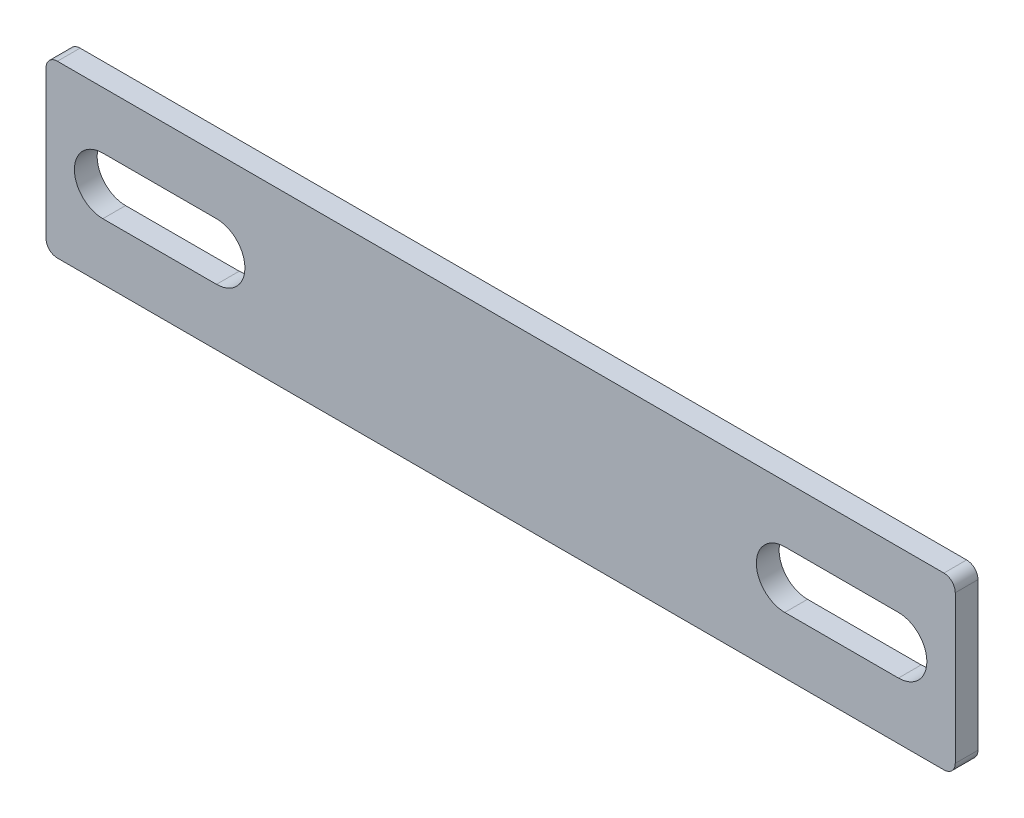
ISO-10303-21;
HEADER;
FILE_DESCRIPTION(('STEP AP214'),'2;1');
FILE_NAME('part.step','',(''),(''),'','','');
FILE_SCHEMA(('AUTOMOTIVE_DESIGN { 1 0 10303 214 1 1 1 1 }'));
ENDSEC;
DATA;
#1=APPLICATION_CONTEXT('core data for automotive mechanical design processes');
#2=APPLICATION_PROTOCOL_DEFINITION('international standard','automotive_design',2000,#1);
#3=PRODUCT_CONTEXT('',#1,'mechanical');
#4=PRODUCT('Part','Part','',(#3));
#5=PRODUCT_RELATED_PRODUCT_CATEGORY('part','',(#4));
#6=PRODUCT_DEFINITION_FORMATION('','',#4);
#7=PRODUCT_DEFINITION_CONTEXT('part definition',#1,'design');
#8=PRODUCT_DEFINITION('design','',#6,#7);
#9=PRODUCT_DEFINITION_SHAPE('','',#8);
#10=(LENGTH_UNIT() NAMED_UNIT(*) SI_UNIT(.MILLI.,.METRE.));
#11=(NAMED_UNIT(*) PLANE_ANGLE_UNIT() SI_UNIT($,.RADIAN.));
#12=(NAMED_UNIT(*) SI_UNIT($,.STERADIAN.) SOLID_ANGLE_UNIT());
#13=UNCERTAINTY_MEASURE_WITH_UNIT(LENGTH_MEASURE(1.E-05),#10,'distance_accuracy_value','');
#14=(GEOMETRIC_REPRESENTATION_CONTEXT(3) GLOBAL_UNCERTAINTY_ASSIGNED_CONTEXT((#13)) GLOBAL_UNIT_ASSIGNED_CONTEXT((#10,
#11,#12)) REPRESENTATION_CONTEXT('',''));
#15=CARTESIAN_POINT('',(0.,0.,0.));
#16=DIRECTION('',(0.,0.,1.));
#17=DIRECTION('',(1.,0.,0.));
#18=AXIS2_PLACEMENT_3D('',#15,#16,#17);
#19=CARTESIAN_POINT('',(-39.,6.5,0.));
#20=DIRECTION('',(0.,0.,1.));
#21=DIRECTION('',(1.,0.,0.));
#22=AXIS2_PLACEMENT_3D('',#19,#20,#21);
#23=CYLINDRICAL_SURFACE('',#22,1.);
#24=CARTESIAN_POINT('',(-39.,6.5,0.));
#25=DIRECTION('',(0.,0.,1.));
#26=DIRECTION('',(1.,0.,0.));
#27=AXIS2_PLACEMENT_3D('',#24,#25,#26);
#28=CIRCLE('',#27,1.);
#29=CARTESIAN_POINT('',(-39.,7.5,0.));
#30=VERTEX_POINT('',#29);
#31=CARTESIAN_POINT('',(-40.,6.5,0.));
#32=VERTEX_POINT('',#31);
#33=EDGE_CURVE('E19',#30,#32,#28,.T.);
#34=ORIENTED_EDGE('',*,*,#33,.T.);
#35=DIRECTION('',(0.,0.,1.));
#36=VECTOR('',#35,1.);
#37=CARTESIAN_POINT('',(-40.,6.5,0.));
#38=LINE('',#37,#36);
#39=CARTESIAN_POINT('',(-40.,6.5,2.));
#40=VERTEX_POINT('',#39);
#41=EDGE_CURVE('E61',#40,#32,#38,.F.);
#42=ORIENTED_EDGE('',*,*,#41,.F.);
#43=CARTESIAN_POINT('',(-39.,6.5,2.));
#44=DIRECTION('',(0.,0.,1.));
#45=DIRECTION('',(1.,0.,0.));
#46=AXIS2_PLACEMENT_3D('',#43,#44,#45);
#47=CIRCLE('',#46,1.);
#48=CARTESIAN_POINT('',(-39.,7.5,2.));
#49=VERTEX_POINT('',#48);
#50=EDGE_CURVE('E193',#49,#40,#47,.T.);
#51=ORIENTED_EDGE('',*,*,#50,.F.);
#52=DIRECTION('',(0.,0.,1.));
#53=VECTOR('',#52,1.);
#54=CARTESIAN_POINT('',(-39.,7.5,0.));
#55=LINE('',#54,#53);
#56=EDGE_CURVE('E63',#30,#49,#55,.T.);
#57=ORIENTED_EDGE('',*,*,#56,.F.);
#58=EDGE_LOOP('',(#34,#42,#51,#57));
#59=FACE_BOUND('',#58,.T.);
#60=ADVANCED_FACE('F16',(#59),#23,.T.);
#61=CARTESIAN_POINT('',(-39.,-6.49999999999999,0.));
#62=DIRECTION('',(0.,0.,1.));
#63=DIRECTION('',(1.,0.,0.));
#64=AXIS2_PLACEMENT_3D('',#61,#62,#63);
#65=CYLINDRICAL_SURFACE('',#64,1.);
#66=CARTESIAN_POINT('',(-39.,-6.49999999999999,0.));
#67=DIRECTION('',(0.,0.,1.));
#68=DIRECTION('',(1.,0.,0.));
#69=AXIS2_PLACEMENT_3D('',#66,#67,#68);
#70=CIRCLE('',#69,1.);
#71=CARTESIAN_POINT('',(-40.,-6.49999999999999,0.));
#72=VERTEX_POINT('',#71);
#73=CARTESIAN_POINT('',(-39.,-7.49999999999999,0.));
#74=VERTEX_POINT('',#73);
#75=EDGE_CURVE('E65',#72,#74,#70,.T.);
#76=ORIENTED_EDGE('',*,*,#75,.T.);
#77=DIRECTION('',(0.,0.,1.));
#78=VECTOR('',#77,1.);
#79=CARTESIAN_POINT('',(-39.,-7.49999999999999,0.));
#80=LINE('',#79,#78);
#81=CARTESIAN_POINT('',(-39.,-7.49999999999999,2.));
#82=VERTEX_POINT('',#81);
#83=EDGE_CURVE('E109',#82,#74,#80,.F.);
#84=ORIENTED_EDGE('',*,*,#83,.F.);
#85=CARTESIAN_POINT('',(-39.,-6.49999999999999,2.));
#86=DIRECTION('',(0.,0.,1.));
#87=DIRECTION('',(1.,0.,0.));
#88=AXIS2_PLACEMENT_3D('',#85,#86,#87);
#89=CIRCLE('',#88,1.);
#90=CARTESIAN_POINT('',(-40.,-6.49999999999999,2.));
#91=VERTEX_POINT('',#90);
#92=EDGE_CURVE('E190',#91,#82,#89,.T.);
#93=ORIENTED_EDGE('',*,*,#92,.F.);
#94=DIRECTION('',(0.,0.,1.));
#95=VECTOR('',#94,1.);
#96=CARTESIAN_POINT('',(-40.,-6.49999999999999,0.));
#97=LINE('',#96,#95);
#98=EDGE_CURVE('E115',#72,#91,#97,.T.);
#99=ORIENTED_EDGE('',*,*,#98,.F.);
#100=EDGE_LOOP('',(#76,#84,#93,#99));
#101=FACE_BOUND('',#100,.T.);
#102=ADVANCED_FACE('F201',(#101),#65,.T.);
#103=CARTESIAN_POINT('',(39.,6.5,0.));
#104=DIRECTION('',(0.,0.,1.));
#105=DIRECTION('',(1.,0.,0.));
#106=AXIS2_PLACEMENT_3D('',#103,#104,#105);
#107=CYLINDRICAL_SURFACE('',#106,1.);
#108=CARTESIAN_POINT('',(39.,6.5,0.));
#109=DIRECTION('',(0.,0.,1.));
#110=DIRECTION('',(1.,0.,0.));
#111=AXIS2_PLACEMENT_3D('',#108,#109,#110);
#112=CIRCLE('',#111,1.);
#113=CARTESIAN_POINT('',(40.,6.5,0.));
#114=VERTEX_POINT('',#113);
#115=CARTESIAN_POINT('',(39.,7.5,0.));
#116=VERTEX_POINT('',#115);
#117=EDGE_CURVE('E34',#114,#116,#112,.T.);
#118=ORIENTED_EDGE('',*,*,#117,.T.);
#119=DIRECTION('',(0.,0.,1.));
#120=VECTOR('',#119,1.);
#121=CARTESIAN_POINT('',(39.,7.5,0.));
#122=LINE('',#121,#120);
#123=CARTESIAN_POINT('',(39.,7.5,2.));
#124=VERTEX_POINT('',#123);
#125=EDGE_CURVE('E118',#124,#116,#122,.F.);
#126=ORIENTED_EDGE('',*,*,#125,.F.);
#127=CARTESIAN_POINT('',(39.,6.5,2.));
#128=DIRECTION('',(0.,0.,1.));
#129=DIRECTION('',(1.,0.,0.));
#130=AXIS2_PLACEMENT_3D('',#127,#128,#129);
#131=CIRCLE('',#130,1.);
#132=CARTESIAN_POINT('',(40.,6.5,2.));
#133=VERTEX_POINT('',#132);
#134=EDGE_CURVE('E196',#133,#124,#131,.T.);
#135=ORIENTED_EDGE('',*,*,#134,.F.);
#136=DIRECTION('',(0.,0.,1.));
#137=VECTOR('',#136,1.);
#138=CARTESIAN_POINT('',(40.,6.5,0.));
#139=LINE('',#138,#137);
#140=EDGE_CURVE('E106',#114,#133,#139,.T.);
#141=ORIENTED_EDGE('',*,*,#140,.F.);
#142=EDGE_LOOP('',(#118,#126,#135,#141));
#143=FACE_BOUND('',#142,.T.);
#144=ADVANCED_FACE('F290',(#143),#107,.T.);
#145=CARTESIAN_POINT('',(0.,0.,2.));
#146=DIRECTION('',(0.,0.,1.));
#147=DIRECTION('',(1.,0.,0.));
#148=AXIS2_PLACEMENT_3D('',#145,#146,#147);
#149=PLANE('',#148);
#150=DIRECTION('',(-1.,0.,0.));
#151=VECTOR('',#150,1.);
#152=CARTESIAN_POINT('',(-25.,2.5,2.));
#153=LINE('',#152,#151);
#154=CARTESIAN_POINT('',(-35.,2.5,2.));
#155=VERTEX_POINT('',#154);
#156=CARTESIAN_POINT('',(-25.,2.5,2.));
#157=VERTEX_POINT('',#156);
#158=EDGE_CURVE('E133',#155,#157,#153,.F.);
#159=ORIENTED_EDGE('',*,*,#158,.T.);
#160=CARTESIAN_POINT('',(-25.,0.,2.));
#161=DIRECTION('',(0.,0.,-1.));
#162=DIRECTION('',(-1.,0.,0.));
#163=AXIS2_PLACEMENT_3D('',#160,#161,#162);
#164=CIRCLE('',#163,2.5);
#165=CARTESIAN_POINT('',(-25.,-2.5,2.));
#166=VERTEX_POINT('',#165);
#167=EDGE_CURVE('E127',#157,#166,#164,.T.);
#168=ORIENTED_EDGE('',*,*,#167,.T.);
#169=DIRECTION('',(1.,0.,0.));
#170=VECTOR('',#169,1.);
#171=CARTESIAN_POINT('',(-35.,-2.5,2.));
#172=LINE('',#171,#170);
#173=CARTESIAN_POINT('',(-35.,-2.5,2.));
#174=VERTEX_POINT('',#173);
#175=EDGE_CURVE('E126',#166,#174,#172,.F.);
#176=ORIENTED_EDGE('',*,*,#175,.T.);
#177=CARTESIAN_POINT('',(-35.,0.,2.));
#178=DIRECTION('',(0.,0.,-1.));
#179=DIRECTION('',(-1.,0.,0.));
#180=AXIS2_PLACEMENT_3D('',#177,#178,#179);
#181=CIRCLE('',#180,2.5);
#182=EDGE_CURVE('E137',#174,#155,#181,.T.);
#183=ORIENTED_EDGE('',*,*,#182,.T.);
#184=EDGE_LOOP('',(#159,#168,#176,#183));
#185=FACE_BOUND('',#184,.T.);
#186=DIRECTION('',(-1.,0.,0.));
#187=VECTOR('',#186,1.);
#188=CARTESIAN_POINT('',(35.,2.5,2.));
#189=LINE('',#188,#187);
#190=CARTESIAN_POINT('',(25.,2.5,2.));
#191=VERTEX_POINT('',#190);
#192=CARTESIAN_POINT('',(35.,2.5,2.));
#193=VERTEX_POINT('',#192);
#194=EDGE_CURVE('E149',#191,#193,#189,.F.);
#195=ORIENTED_EDGE('',*,*,#194,.T.);
#196=CARTESIAN_POINT('',(35.,0.,2.));
#197=DIRECTION('',(0.,0.,-1.));
#198=DIRECTION('',(-1.,0.,0.));
#199=AXIS2_PLACEMENT_3D('',#196,#197,#198);
#200=CIRCLE('',#199,2.5);
#201=CARTESIAN_POINT('',(35.,-2.5,2.));
#202=VERTEX_POINT('',#201);
#203=EDGE_CURVE('E142',#193,#202,#200,.T.);
#204=ORIENTED_EDGE('',*,*,#203,.T.);
#205=DIRECTION('',(1.,0.,0.));
#206=VECTOR('',#205,1.);
#207=CARTESIAN_POINT('',(25.,-2.5,2.));
#208=LINE('',#207,#206);
#209=CARTESIAN_POINT('',(25.,-2.5,2.));
#210=VERTEX_POINT('',#209);
#211=EDGE_CURVE('E141',#202,#210,#208,.F.);
#212=ORIENTED_EDGE('',*,*,#211,.T.);
#213=CARTESIAN_POINT('',(25.,0.,2.));
#214=DIRECTION('',(0.,0.,-1.));
#215=DIRECTION('',(-1.,0.,0.));
#216=AXIS2_PLACEMENT_3D('',#213,#214,#215);
#217=CIRCLE('',#216,2.5);
#218=EDGE_CURVE('E153',#210,#191,#217,.T.);
#219=ORIENTED_EDGE('',*,*,#218,.T.);
#220=EDGE_LOOP('',(#195,#204,#212,#219));
#221=FACE_BOUND('',#220,.T.);
#222=CARTESIAN_POINT('',(39.,-6.5,2.));
#223=DIRECTION('',(0.,0.,1.));
#224=DIRECTION('',(1.,0.,0.));
#225=AXIS2_PLACEMENT_3D('',#222,#223,#224);
#226=CIRCLE('',#225,1.);
#227=CARTESIAN_POINT('',(40.,-6.5,2.));
#228=VERTEX_POINT('',#227);
#229=CARTESIAN_POINT('',(39.,-7.5,2.));
#230=VERTEX_POINT('',#229);
#231=EDGE_CURVE('E187',#228,#230,#226,.F.);
#232=ORIENTED_EDGE('',*,*,#231,.F.);
#233=DIRECTION('',(0.,1.,0.));
#234=VECTOR('',#233,1.);
#235=CARTESIAN_POINT('',(40.,7.5,2.));
#236=LINE('',#235,#234);
#237=EDGE_CURVE('E105',#133,#228,#236,.F.);
#238=ORIENTED_EDGE('',*,*,#237,.F.);
#239=ORIENTED_EDGE('',*,*,#134,.T.);
#240=DIRECTION('',(1.,0.,0.));
#241=VECTOR('',#240,1.);
#242=CARTESIAN_POINT('',(-40.,7.5,2.));
#243=LINE('',#242,#241);
#244=EDGE_CURVE('E117',#49,#124,#243,.T.);
#245=ORIENTED_EDGE('',*,*,#244,.F.);
#246=ORIENTED_EDGE('',*,*,#50,.T.);
#247=DIRECTION('',(0.,1.,0.));
#248=VECTOR('',#247,1.);
#249=CARTESIAN_POINT('',(-40.,-7.49999999999999,2.));
#250=LINE('',#249,#248);
#251=EDGE_CURVE('E73',#91,#40,#250,.T.);
#252=ORIENTED_EDGE('',*,*,#251,.F.);
#253=ORIENTED_EDGE('',*,*,#92,.T.);
#254=DIRECTION('',(1.,0.,0.));
#255=VECTOR('',#254,1.);
#256=CARTESIAN_POINT('',(40.,-7.5,2.));
#257=LINE('',#256,#255);
#258=EDGE_CURVE('E112',#230,#82,#257,.F.);
#259=ORIENTED_EDGE('',*,*,#258,.F.);
#260=EDGE_LOOP('',(#232,#238,#239,#245,#246,#252,#253,#259));
#261=FACE_BOUND('',#260,.T.);
#262=ADVANCED_FACE('F217',(#185,#221,#261),#149,.T.);
#263=CARTESIAN_POINT('',(39.,-6.5,0.));
#264=DIRECTION('',(0.,0.,1.));
#265=DIRECTION('',(1.,0.,0.));
#266=AXIS2_PLACEMENT_3D('',#263,#264,#265);
#267=CYLINDRICAL_SURFACE('',#266,1.);
#268=CARTESIAN_POINT('',(39.,-6.5,0.));
#269=DIRECTION('',(0.,0.,1.));
#270=DIRECTION('',(1.,0.,0.));
#271=AXIS2_PLACEMENT_3D('',#268,#269,#270);
#272=CIRCLE('',#271,1.);
#273=CARTESIAN_POINT('',(39.,-7.49999999999999,0.));
#274=VERTEX_POINT('',#273);
#275=CARTESIAN_POINT('',(40.,-6.5,0.));
#276=VERTEX_POINT('',#275);
#277=EDGE_CURVE('E185',#274,#276,#272,.T.);
#278=ORIENTED_EDGE('',*,*,#277,.T.);
#279=DIRECTION('',(0.,0.,1.));
#280=VECTOR('',#279,1.);
#281=CARTESIAN_POINT('',(40.,-6.5,0.));
#282=LINE('',#281,#280);
#283=EDGE_CURVE('E102',#228,#276,#282,.F.);
#284=ORIENTED_EDGE('',*,*,#283,.F.);
#285=ORIENTED_EDGE('',*,*,#231,.T.);
#286=DIRECTION('',(0.,0.,1.));
#287=VECTOR('',#286,1.);
#288=CARTESIAN_POINT('',(39.,-7.5,0.));
#289=LINE('',#288,#287);
#290=EDGE_CURVE('E74',#274,#230,#289,.T.);
#291=ORIENTED_EDGE('',*,*,#290,.F.);
#292=EDGE_LOOP('',(#278,#284,#285,#291));
#293=FACE_BOUND('',#292,.T.);
#294=ADVANCED_FACE('F212',(#293),#267,.T.);
#295=CARTESIAN_POINT('',(25.,0.,2.));
#296=DIRECTION('',(0.,0.,-1.));
#297=DIRECTION('',(-1.,0.,0.));
#298=AXIS2_PLACEMENT_3D('',#295,#296,#297);
#299=CYLINDRICAL_SURFACE('',#298,2.5);
#300=DIRECTION('',(0.,0.,1.));
#301=VECTOR('',#300,1.);
#302=CARTESIAN_POINT('',(25.,2.5,2.));
#303=LINE('',#302,#301);
#304=CARTESIAN_POINT('',(25.,2.5,0.));
#305=VERTEX_POINT('',#304);
#306=EDGE_CURVE('E150',#305,#191,#303,.T.);
#307=ORIENTED_EDGE('',*,*,#306,.T.);
#308=ORIENTED_EDGE('',*,*,#218,.F.);
#309=DIRECTION('',(0.,0.,1.));
#310=VECTOR('',#309,1.);
#311=CARTESIAN_POINT('',(25.,-2.5,2.));
#312=LINE('',#311,#310);
#313=CARTESIAN_POINT('',(25.,-2.5,0.));
#314=VERTEX_POINT('',#313);
#315=EDGE_CURVE('E143',#210,#314,#312,.F.);
#316=ORIENTED_EDGE('',*,*,#315,.T.);
#317=CARTESIAN_POINT('',(25.,0.,0.));
#318=DIRECTION('',(0.,0.,-1.));
#319=DIRECTION('',(-1.,0.,0.));
#320=AXIS2_PLACEMENT_3D('',#317,#318,#319);
#321=CIRCLE('',#320,2.5);
#322=EDGE_CURVE('E101',#314,#305,#321,.T.);
#323=ORIENTED_EDGE('',*,*,#322,.T.);
#324=EDGE_LOOP('',(#307,#308,#316,#323));
#325=FACE_BOUND('',#324,.T.);
#326=ADVANCED_FACE('F303',(#325),#299,.F.);
#327=CARTESIAN_POINT('',(35.,2.5,2.));
#328=DIRECTION('',(0.,1.,0.));
#329=DIRECTION('',(-1.,0.,0.));
#330=AXIS2_PLACEMENT_3D('',#327,#328,#329);
#331=PLANE('',#330);
#332=DIRECTION('',(0.,0.,-1.));
#333=VECTOR('',#332,1.);
#334=CARTESIAN_POINT('',(35.,2.5,2.));
#335=LINE('',#334,#333);
#336=CARTESIAN_POINT('',(35.,2.5,0.));
#337=VERTEX_POINT('',#336);
#338=EDGE_CURVE('E146',#337,#193,#335,.F.);
#339=ORIENTED_EDGE('',*,*,#338,.T.);
#340=ORIENTED_EDGE('',*,*,#194,.F.);
#341=ORIENTED_EDGE('',*,*,#306,.F.);
#342=DIRECTION('',(1.,0.,0.));
#343=VECTOR('',#342,1.);
#344=CARTESIAN_POINT('',(0.,2.5,0.));
#345=LINE('',#344,#343);
#346=EDGE_CURVE('E98',#305,#337,#345,.T.);
#347=ORIENTED_EDGE('',*,*,#346,.T.);
#348=EDGE_LOOP('',(#339,#340,#341,#347));
#349=FACE_BOUND('',#348,.T.);
#350=ADVANCED_FACE('F299',(#349),#331,.F.);
#351=CARTESIAN_POINT('',(35.,0.,2.));
#352=DIRECTION('',(0.,0.,-1.));
#353=DIRECTION('',(-1.,0.,0.));
#354=AXIS2_PLACEMENT_3D('',#351,#352,#353);
#355=CYLINDRICAL_SURFACE('',#354,2.5);
#356=DIRECTION('',(0.,0.,1.));
#357=VECTOR('',#356,1.);
#358=CARTESIAN_POINT('',(35.,-2.5,2.));
#359=LINE('',#358,#357);
#360=CARTESIAN_POINT('',(35.,-2.5,0.));
#361=VERTEX_POINT('',#360);
#362=EDGE_CURVE('E138',#361,#202,#359,.T.);
#363=ORIENTED_EDGE('',*,*,#362,.T.);
#364=ORIENTED_EDGE('',*,*,#203,.F.);
#365=ORIENTED_EDGE('',*,*,#338,.F.);
#366=CARTESIAN_POINT('',(35.,0.,0.));
#367=DIRECTION('',(0.,0.,-1.));
#368=DIRECTION('',(-1.,0.,0.));
#369=AXIS2_PLACEMENT_3D('',#366,#367,#368);
#370=CIRCLE('',#369,2.5);
#371=EDGE_CURVE('E97',#337,#361,#370,.T.);
#372=ORIENTED_EDGE('',*,*,#371,.T.);
#373=EDGE_LOOP('',(#363,#364,#365,#372));
#374=FACE_BOUND('',#373,.T.);
#375=ADVANCED_FACE('F297',(#374),#355,.F.);
#376=CARTESIAN_POINT('',(25.,-2.5,2.));
#377=DIRECTION('',(0.,-1.,0.));
#378=DIRECTION('',(1.,0.,0.));
#379=AXIS2_PLACEMENT_3D('',#376,#377,#378);
#380=PLANE('',#379);
#381=ORIENTED_EDGE('',*,*,#315,.F.);
#382=ORIENTED_EDGE('',*,*,#211,.F.);
#383=ORIENTED_EDGE('',*,*,#362,.F.);
#384=DIRECTION('',(1.,0.,0.));
#385=VECTOR('',#384,1.);
#386=CARTESIAN_POINT('',(0.,-2.5,0.));
#387=LINE('',#386,#385);
#388=EDGE_CURVE('E94',#361,#314,#387,.F.);
#389=ORIENTED_EDGE('',*,*,#388,.T.);
#390=EDGE_LOOP('',(#381,#382,#383,#389));
#391=FACE_BOUND('',#390,.T.);
#392=ADVANCED_FACE('F306',(#391),#380,.F.);
#393=CARTESIAN_POINT('',(-35.,0.,2.));
#394=DIRECTION('',(0.,0.,-1.));
#395=DIRECTION('',(-1.,0.,0.));
#396=AXIS2_PLACEMENT_3D('',#393,#394,#395);
#397=CYLINDRICAL_SURFACE('',#396,2.5);
#398=DIRECTION('',(0.,0.,1.));
#399=VECTOR('',#398,1.);
#400=CARTESIAN_POINT('',(-35.,2.5,2.));
#401=LINE('',#400,#399);
#402=CARTESIAN_POINT('',(-35.,2.5,0.));
#403=VERTEX_POINT('',#402);
#404=EDGE_CURVE('E134',#403,#155,#401,.T.);
#405=ORIENTED_EDGE('',*,*,#404,.T.);
#406=ORIENTED_EDGE('',*,*,#182,.F.);
#407=DIRECTION('',(0.,0.,1.));
#408=VECTOR('',#407,1.);
#409=CARTESIAN_POINT('',(-35.,-2.5,2.));
#410=LINE('',#409,#408);
#411=CARTESIAN_POINT('',(-35.,-2.5,0.));
#412=VERTEX_POINT('',#411);
#413=EDGE_CURVE('E121',#174,#412,#410,.F.);
#414=ORIENTED_EDGE('',*,*,#413,.T.);
#415=CARTESIAN_POINT('',(-35.,0.,0.));
#416=DIRECTION('',(0.,0.,-1.));
#417=DIRECTION('',(-1.,0.,0.));
#418=AXIS2_PLACEMENT_3D('',#415,#416,#417);
#419=CIRCLE('',#418,2.5);
#420=EDGE_CURVE('E93',#412,#403,#419,.T.);
#421=ORIENTED_EDGE('',*,*,#420,.T.);
#422=EDGE_LOOP('',(#405,#406,#414,#421));
#423=FACE_BOUND('',#422,.T.);
#424=ADVANCED_FACE('F282',(#423),#397,.F.);
#425=CARTESIAN_POINT('',(-25.,2.5,2.));
#426=DIRECTION('',(0.,1.,0.));
#427=DIRECTION('',(-1.,0.,0.));
#428=AXIS2_PLACEMENT_3D('',#425,#426,#427);
#429=PLANE('',#428);
#430=DIRECTION('',(0.,0.,-1.));
#431=VECTOR('',#430,1.);
#432=CARTESIAN_POINT('',(-25.,2.5,2.));
#433=LINE('',#432,#431);
#434=CARTESIAN_POINT('',(-25.,2.5,0.));
#435=VERTEX_POINT('',#434);
#436=EDGE_CURVE('E130',#435,#157,#433,.F.);
#437=ORIENTED_EDGE('',*,*,#436,.T.);
#438=ORIENTED_EDGE('',*,*,#158,.F.);
#439=ORIENTED_EDGE('',*,*,#404,.F.);
#440=DIRECTION('',(1.,0.,0.));
#441=VECTOR('',#440,1.);
#442=CARTESIAN_POINT('',(0.,2.5,0.));
#443=LINE('',#442,#441);
#444=EDGE_CURVE('E90',#403,#435,#443,.T.);
#445=ORIENTED_EDGE('',*,*,#444,.T.);
#446=EDGE_LOOP('',(#437,#438,#439,#445));
#447=FACE_BOUND('',#446,.T.);
#448=ADVANCED_FACE('F280',(#447),#429,.F.);
#449=CARTESIAN_POINT('',(-25.,0.,2.));
#450=DIRECTION('',(0.,0.,-1.));
#451=DIRECTION('',(-1.,0.,0.));
#452=AXIS2_PLACEMENT_3D('',#449,#450,#451);
#453=CYLINDRICAL_SURFACE('',#452,2.5);
#454=DIRECTION('',(0.,0.,1.));
#455=VECTOR('',#454,1.);
#456=CARTESIAN_POINT('',(-25.,-2.5,2.));
#457=LINE('',#456,#455);
#458=CARTESIAN_POINT('',(-25.,-2.5,0.));
#459=VERTEX_POINT('',#458);
#460=EDGE_CURVE('E123',#459,#166,#457,.T.);
#461=ORIENTED_EDGE('',*,*,#460,.T.);
#462=ORIENTED_EDGE('',*,*,#167,.F.);
#463=ORIENTED_EDGE('',*,*,#436,.F.);
#464=CARTESIAN_POINT('',(-25.,0.,0.));
#465=DIRECTION('',(0.,0.,-1.));
#466=DIRECTION('',(-1.,0.,0.));
#467=AXIS2_PLACEMENT_3D('',#464,#465,#466);
#468=CIRCLE('',#467,2.5);
#469=EDGE_CURVE('E89',#435,#459,#468,.T.);
#470=ORIENTED_EDGE('',*,*,#469,.T.);
#471=EDGE_LOOP('',(#461,#462,#463,#470));
#472=FACE_BOUND('',#471,.T.);
#473=ADVANCED_FACE('F274',(#472),#453,.F.);
#474=CARTESIAN_POINT('',(-35.,-2.5,2.));
#475=DIRECTION('',(0.,-1.,0.));
#476=DIRECTION('',(1.,0.,0.));
#477=AXIS2_PLACEMENT_3D('',#474,#475,#476);
#478=PLANE('',#477);
#479=ORIENTED_EDGE('',*,*,#413,.F.);
#480=ORIENTED_EDGE('',*,*,#175,.F.);
#481=ORIENTED_EDGE('',*,*,#460,.F.);
#482=DIRECTION('',(1.,0.,0.));
#483=VECTOR('',#482,1.);
#484=CARTESIAN_POINT('',(0.,-2.5,0.));
#485=LINE('',#484,#483);
#486=EDGE_CURVE('E84',#459,#412,#485,.F.);
#487=ORIENTED_EDGE('',*,*,#486,.T.);
#488=EDGE_LOOP('',(#479,#480,#481,#487));
#489=FACE_BOUND('',#488,.T.);
#490=ADVANCED_FACE('F286',(#489),#478,.F.);
#491=CARTESIAN_POINT('',(-40.,7.5,0.));
#492=DIRECTION('',(0.,1.,0.));
#493=DIRECTION('',(0.,0.,1.));
#494=AXIS2_PLACEMENT_3D('',#491,#492,#493);
#495=PLANE('',#494);
#496=ORIENTED_EDGE('',*,*,#56,.T.);
#497=ORIENTED_EDGE('',*,*,#244,.T.);
#498=ORIENTED_EDGE('',*,*,#125,.T.);
#499=DIRECTION('',(1.,0.,0.));
#500=VECTOR('',#499,1.);
#501=CARTESIAN_POINT('',(0.,7.5,0.));
#502=LINE('',#501,#500);
#503=EDGE_CURVE('E80',#116,#30,#502,.F.);
#504=ORIENTED_EDGE('',*,*,#503,.T.);
#505=EDGE_LOOP('',(#496,#497,#498,#504));
#506=FACE_BOUND('',#505,.T.);
#507=ADVANCED_FACE('F328',(#506),#495,.T.);
#508=CARTESIAN_POINT('',(-40.,-7.49999999999999,0.));
#509=DIRECTION('',(-1.,0.,0.));
#510=DIRECTION('',(0.,0.,1.));
#511=AXIS2_PLACEMENT_3D('',#508,#509,#510);
#512=PLANE('',#511);
#513=ORIENTED_EDGE('',*,*,#41,.T.);
#514=DIRECTION('',(0.,1.,0.));
#515=VECTOR('',#514,1.);
#516=CARTESIAN_POINT('',(-40.,0.,0.));
#517=LINE('',#516,#515);
#518=EDGE_CURVE('E71',#32,#72,#517,.F.);
#519=ORIENTED_EDGE('',*,*,#518,.T.);
#520=ORIENTED_EDGE('',*,*,#98,.T.);
#521=ORIENTED_EDGE('',*,*,#251,.T.);
#522=EDGE_LOOP('',(#513,#519,#520,#521));
#523=FACE_BOUND('',#522,.T.);
#524=ADVANCED_FACE('F69',(#523),#512,.T.);
#525=CARTESIAN_POINT('',(40.,-7.5,0.));
#526=DIRECTION('',(0.,-1.,0.));
#527=DIRECTION('',(1.,0.,0.));
#528=AXIS2_PLACEMENT_3D('',#525,#526,#527);
#529=PLANE('',#528);
#530=ORIENTED_EDGE('',*,*,#83,.T.);
#531=DIRECTION('',(1.,0.,0.));
#532=VECTOR('',#531,1.);
#533=CARTESIAN_POINT('',(0.,-7.49999999999999,0.));
#534=LINE('',#533,#532);
#535=EDGE_CURVE('E25',#74,#274,#534,.T.);
#536=ORIENTED_EDGE('',*,*,#535,.T.);
#537=ORIENTED_EDGE('',*,*,#290,.T.);
#538=ORIENTED_EDGE('',*,*,#258,.T.);
#539=EDGE_LOOP('',(#530,#536,#537,#538));
#540=FACE_BOUND('',#539,.T.);
#541=ADVANCED_FACE('F205',(#540),#529,.T.);
#542=CARTESIAN_POINT('',(40.,7.5,0.));
#543=DIRECTION('',(1.,0.,0.));
#544=DIRECTION('',(0.,1.,0.));
#545=AXIS2_PLACEMENT_3D('',#542,#543,#544);
#546=PLANE('',#545);
#547=ORIENTED_EDGE('',*,*,#283,.T.);
#548=DIRECTION('',(0.,1.,0.));
#549=VECTOR('',#548,1.);
#550=CARTESIAN_POINT('',(40.,0.,0.));
#551=LINE('',#550,#549);
#552=EDGE_CURVE('E11',#276,#114,#551,.T.);
#553=ORIENTED_EDGE('',*,*,#552,.T.);
#554=ORIENTED_EDGE('',*,*,#140,.T.);
#555=ORIENTED_EDGE('',*,*,#237,.T.);
#556=EDGE_LOOP('',(#547,#553,#554,#555));
#557=FACE_BOUND('',#556,.T.);
#558=ADVANCED_FACE('F317',(#557),#546,.T.);
#559=CARTESIAN_POINT('',(0.,0.,0.));
#560=DIRECTION('',(0.,0.,1.));
#561=DIRECTION('',(1.,0.,0.));
#562=AXIS2_PLACEMENT_3D('',#559,#560,#561);
#563=PLANE('',#562);
#564=ORIENTED_EDGE('',*,*,#552,.F.);
#565=ORIENTED_EDGE('',*,*,#277,.F.);
#566=ORIENTED_EDGE('',*,*,#535,.F.);
#567=ORIENTED_EDGE('',*,*,#75,.F.);
#568=ORIENTED_EDGE('',*,*,#518,.F.);
#569=ORIENTED_EDGE('',*,*,#33,.F.);
#570=ORIENTED_EDGE('',*,*,#503,.F.);
#571=ORIENTED_EDGE('',*,*,#117,.F.);
#572=EDGE_LOOP('',(#564,#565,#566,#567,#568,#569,#570,#571));
#573=FACE_BOUND('',#572,.T.);
#574=ORIENTED_EDGE('',*,*,#469,.F.);
#575=ORIENTED_EDGE('',*,*,#444,.F.);
#576=ORIENTED_EDGE('',*,*,#420,.F.);
#577=ORIENTED_EDGE('',*,*,#486,.F.);
#578=EDGE_LOOP('',(#574,#575,#576,#577));
#579=FACE_BOUND('',#578,.T.);
#580=ORIENTED_EDGE('',*,*,#371,.F.);
#581=ORIENTED_EDGE('',*,*,#346,.F.);
#582=ORIENTED_EDGE('',*,*,#322,.F.);
#583=ORIENTED_EDGE('',*,*,#388,.F.);
#584=EDGE_LOOP('',(#580,#581,#582,#583));
#585=FACE_BOUND('',#584,.T.);
#586=ADVANCED_FACE('F76',(#573,#579,#585),#563,.F.);
#587=CLOSED_SHELL('',(#60,#102,#144,#262,#294,#326,#350,#375,#392,#424,#448,#473,#490,#507,#524,
#541,#558,#586));
#588=MANIFOLD_SOLID_BREP('B1',#587);
#589=ADVANCED_BREP_SHAPE_REPRESENTATION('',(#18,#588),#14);
#590=SHAPE_DEFINITION_REPRESENTATION(#9,#589);
ENDSEC;
END-ISO-10303-21;
